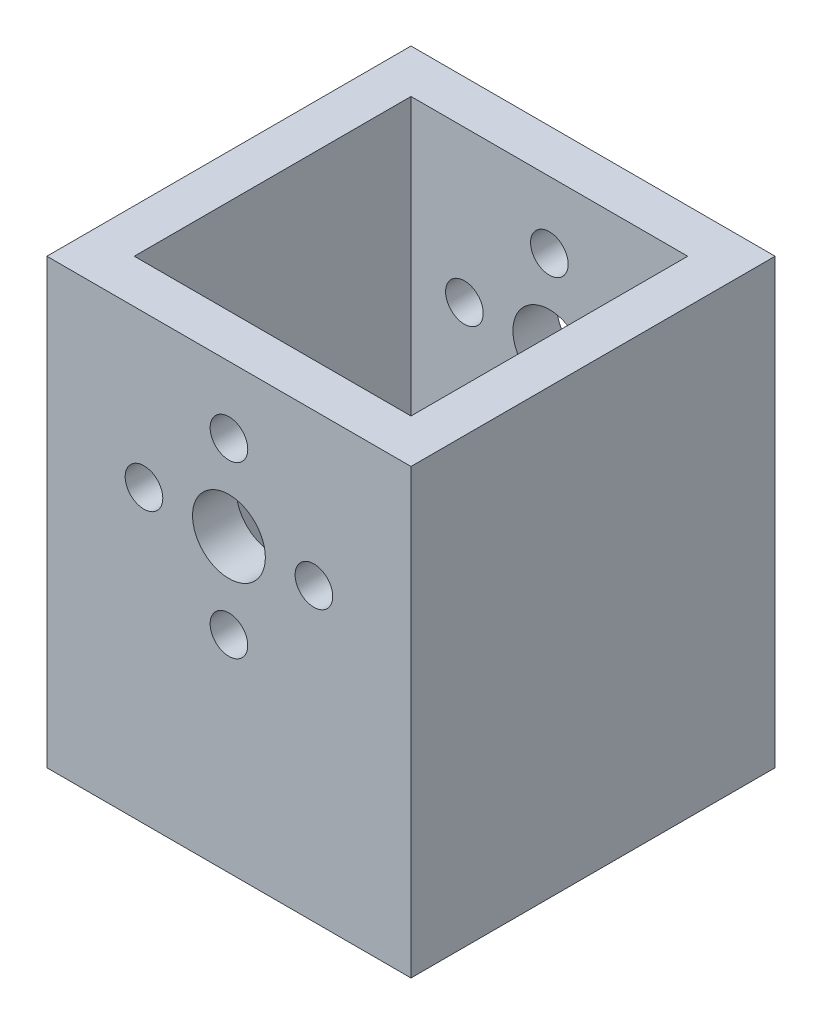
ISO-10303-21;
HEADER;
FILE_DESCRIPTION(('STEP AP214'),'2;1');
FILE_NAME('part.step','',(''),(''),'','','');
FILE_SCHEMA(('AUTOMOTIVE_DESIGN { 1 0 10303 214 1 1 1 1 }'));
ENDSEC;
DATA;
#1=APPLICATION_CONTEXT('core data for automotive mechanical design processes');
#2=APPLICATION_PROTOCOL_DEFINITION('international standard','automotive_design',2000,#1);
#3=PRODUCT_CONTEXT('',#1,'mechanical');
#4=PRODUCT('Part','Part','',(#3));
#5=PRODUCT_RELATED_PRODUCT_CATEGORY('part','',(#4));
#6=PRODUCT_DEFINITION_FORMATION('','',#4);
#7=PRODUCT_DEFINITION_CONTEXT('part definition',#1,'design');
#8=PRODUCT_DEFINITION('design','',#6,#7);
#9=PRODUCT_DEFINITION_SHAPE('','',#8);
#10=(LENGTH_UNIT() NAMED_UNIT(*) SI_UNIT(.MILLI.,.METRE.));
#11=(NAMED_UNIT(*) PLANE_ANGLE_UNIT() SI_UNIT($,.RADIAN.));
#12=(NAMED_UNIT(*) SI_UNIT($,.STERADIAN.) SOLID_ANGLE_UNIT());
#13=UNCERTAINTY_MEASURE_WITH_UNIT(LENGTH_MEASURE(1.E-05),#10,'distance_accuracy_value','');
#14=(GEOMETRIC_REPRESENTATION_CONTEXT(3) GLOBAL_UNCERTAINTY_ASSIGNED_CONTEXT((#13)) GLOBAL_UNIT_ASSIGNED_CONTEXT((#10,
#11,#12)) REPRESENTATION_CONTEXT('',''));
#15=CARTESIAN_POINT('',(0.,0.,0.));
#16=DIRECTION('',(0.,0.,1.));
#17=DIRECTION('',(1.,0.,0.));
#18=AXIS2_PLACEMENT_3D('',#15,#16,#17);
#19=CARTESIAN_POINT('',(0.,0.,30.));
#20=DIRECTION('',(0.,0.,-1.));
#21=DIRECTION('',(-1.,0.,0.));
#22=AXIS2_PLACEMENT_3D('',#19,#20,#21);
#23=CYLINDRICAL_SURFACE('',#22,3.);
#24=CARTESIAN_POINT('',(0.,0.,3.6));
#25=DIRECTION('',(0.,0.,-1.));
#26=DIRECTION('',(-1.,0.,0.));
#27=AXIS2_PLACEMENT_3D('',#24,#25,#26);
#28=CIRCLE('',#27,3.);
#29=CARTESIAN_POINT('',(-3.,0.,3.6));
#30=VERTEX_POINT('',#29);
#31=EDGE_CURVE('E168',#30,#30,#28,.T.);
#32=ORIENTED_EDGE('',*,*,#31,.F.);
#33=EDGE_LOOP('',(#32));
#34=FACE_BOUND('',#33,.T.);
#35=CARTESIAN_POINT('',(0.,0.,0.));
#36=DIRECTION('',(0.,0.,1.));
#37=DIRECTION('',(1.,0.,0.));
#38=AXIS2_PLACEMENT_3D('',#35,#36,#37);
#39=CIRCLE('',#38,3.);
#40=CARTESIAN_POINT('',(3.,0.,0.));
#41=VERTEX_POINT('',#40);
#42=EDGE_CURVE('E208',#41,#41,#39,.T.);
#43=ORIENTED_EDGE('',*,*,#42,.F.);
#44=EDGE_LOOP('',(#43));
#45=FACE_BOUND('',#44,.T.);
#46=ADVANCED_FACE('F37',(#34,#45),#23,.F.);
#47=CARTESIAN_POINT('',(0.,-7.,30.));
#48=DIRECTION('',(0.,0.,-1.));
#49=DIRECTION('',(-1.,0.,0.));
#50=AXIS2_PLACEMENT_3D('',#47,#48,#49);
#51=CYLINDRICAL_SURFACE('',#50,1.55);
#52=CARTESIAN_POINT('',(0.,-7.,3.6));
#53=DIRECTION('',(0.,0.,-1.));
#54=DIRECTION('',(-1.,0.,0.));
#55=AXIS2_PLACEMENT_3D('',#52,#53,#54);
#56=CIRCLE('',#55,1.55);
#57=CARTESIAN_POINT('',(-1.55,-7.,3.6));
#58=VERTEX_POINT('',#57);
#59=EDGE_CURVE('E165',#58,#58,#56,.T.);
#60=ORIENTED_EDGE('',*,*,#59,.F.);
#61=EDGE_LOOP('',(#60));
#62=FACE_BOUND('',#61,.T.);
#63=CARTESIAN_POINT('',(0.,-7.,0.));
#64=DIRECTION('',(0.,0.,1.));
#65=DIRECTION('',(1.,0.,0.));
#66=AXIS2_PLACEMENT_3D('',#63,#64,#65);
#67=CIRCLE('',#66,1.55);
#68=CARTESIAN_POINT('',(1.55,-7.,0.));
#69=VERTEX_POINT('',#68);
#70=EDGE_CURVE('E205',#69,#69,#67,.T.);
#71=ORIENTED_EDGE('',*,*,#70,.F.);
#72=EDGE_LOOP('',(#71));
#73=FACE_BOUND('',#72,.T.);
#74=ADVANCED_FACE('F268',(#62,#73),#51,.F.);
#75=CARTESIAN_POINT('',(7.,0.,30.));
#76=DIRECTION('',(0.,0.,-1.));
#77=DIRECTION('',(-1.,0.,0.));
#78=AXIS2_PLACEMENT_3D('',#75,#76,#77);
#79=CYLINDRICAL_SURFACE('',#78,1.55);
#80=CARTESIAN_POINT('',(7.,0.,3.6));
#81=DIRECTION('',(0.,0.,-1.));
#82=DIRECTION('',(-1.,0.,0.));
#83=AXIS2_PLACEMENT_3D('',#80,#81,#82);
#84=CIRCLE('',#83,1.55);
#85=CARTESIAN_POINT('',(5.45,0.,3.6));
#86=VERTEX_POINT('',#85);
#87=EDGE_CURVE('E162',#86,#86,#84,.T.);
#88=ORIENTED_EDGE('',*,*,#87,.F.);
#89=EDGE_LOOP('',(#88));
#90=FACE_BOUND('',#89,.T.);
#91=CARTESIAN_POINT('',(7.,0.,0.));
#92=DIRECTION('',(0.,0.,1.));
#93=DIRECTION('',(1.,0.,0.));
#94=AXIS2_PLACEMENT_3D('',#91,#92,#93);
#95=CIRCLE('',#94,1.55);
#96=CARTESIAN_POINT('',(8.55,0.,0.));
#97=VERTEX_POINT('',#96);
#98=EDGE_CURVE('E202',#97,#97,#95,.T.);
#99=ORIENTED_EDGE('',*,*,#98,.F.);
#100=EDGE_LOOP('',(#99));
#101=FACE_BOUND('',#100,.T.);
#102=ADVANCED_FACE('F274',(#90,#101),#79,.F.);
#103=CARTESIAN_POINT('',(0.,7.,30.));
#104=DIRECTION('',(0.,0.,-1.));
#105=DIRECTION('',(-1.,0.,0.));
#106=AXIS2_PLACEMENT_3D('',#103,#104,#105);
#107=CYLINDRICAL_SURFACE('',#106,1.55);
#108=CARTESIAN_POINT('',(0.,7.,3.6));
#109=DIRECTION('',(0.,0.,-1.));
#110=DIRECTION('',(-1.,0.,0.));
#111=AXIS2_PLACEMENT_3D('',#108,#109,#110);
#112=CIRCLE('',#111,1.55);
#113=CARTESIAN_POINT('',(-1.55,7.,3.6));
#114=VERTEX_POINT('',#113);
#115=EDGE_CURVE('E159',#114,#114,#112,.T.);
#116=ORIENTED_EDGE('',*,*,#115,.F.);
#117=EDGE_LOOP('',(#116));
#118=FACE_BOUND('',#117,.T.);
#119=CARTESIAN_POINT('',(0.,7.,0.));
#120=DIRECTION('',(0.,0.,1.));
#121=DIRECTION('',(1.,0.,0.));
#122=AXIS2_PLACEMENT_3D('',#119,#120,#121);
#123=CIRCLE('',#122,1.55);
#124=CARTESIAN_POINT('',(1.55,7.,0.));
#125=VERTEX_POINT('',#124);
#126=EDGE_CURVE('E199',#125,#125,#123,.T.);
#127=ORIENTED_EDGE('',*,*,#126,.F.);
#128=EDGE_LOOP('',(#127));
#129=FACE_BOUND('',#128,.T.);
#130=ADVANCED_FACE('F264',(#118,#129),#107,.F.);
#131=CARTESIAN_POINT('',(-7.,0.,30.));
#132=DIRECTION('',(0.,0.,-1.));
#133=DIRECTION('',(-1.,0.,0.));
#134=AXIS2_PLACEMENT_3D('',#131,#132,#133);
#135=CYLINDRICAL_SURFACE('',#134,1.55);
#136=CARTESIAN_POINT('',(-7.,0.,3.6));
#137=DIRECTION('',(0.,0.,-1.));
#138=DIRECTION('',(-1.,0.,0.));
#139=AXIS2_PLACEMENT_3D('',#136,#137,#138);
#140=CIRCLE('',#139,1.55);
#141=CARTESIAN_POINT('',(-8.55,0.,3.6));
#142=VERTEX_POINT('',#141);
#143=EDGE_CURVE('E41',#142,#142,#140,.T.);
#144=ORIENTED_EDGE('',*,*,#143,.F.);
#145=EDGE_LOOP('',(#144));
#146=FACE_BOUND('',#145,.T.);
#147=CARTESIAN_POINT('',(-7.,0.,0.));
#148=DIRECTION('',(0.,0.,1.));
#149=DIRECTION('',(1.,0.,0.));
#150=AXIS2_PLACEMENT_3D('',#147,#148,#149);
#151=CIRCLE('',#150,1.55);
#152=CARTESIAN_POINT('',(-5.45,0.,0.));
#153=VERTEX_POINT('',#152);
#154=EDGE_CURVE('E171',#153,#153,#151,.T.);
#155=ORIENTED_EDGE('',*,*,#154,.F.);
#156=EDGE_LOOP('',(#155));
#157=FACE_BOUND('',#156,.T.);
#158=ADVANCED_FACE('F232',(#146,#157),#135,.F.);
#159=CARTESIAN_POINT('',(0.,12.5,30.));
#160=DIRECTION('',(0.,1.,0.));
#161=DIRECTION('',(0.,0.,1.));
#162=AXIS2_PLACEMENT_3D('',#159,#160,#161);
#163=PLANE('',#162);
#164=DIRECTION('',(0.,0.,1.));
#165=VECTOR('',#164,1.);
#166=CARTESIAN_POINT('',(-11.4,12.5,15.));
#167=LINE('',#166,#165);
#168=CARTESIAN_POINT('',(-11.4,12.5,3.6));
#169=VERTEX_POINT('',#168);
#170=CARTESIAN_POINT('',(-11.4,12.5,26.4));
#171=VERTEX_POINT('',#170);
#172=EDGE_CURVE('E113',#169,#171,#167,.T.);
#173=ORIENTED_EDGE('',*,*,#172,.F.);
#174=DIRECTION('',(-1.,0.,0.));
#175=VECTOR('',#174,1.);
#176=CARTESIAN_POINT('',(0.,12.5,3.6));
#177=LINE('',#176,#175);
#178=CARTESIAN_POINT('',(11.4,12.5,3.6));
#179=VERTEX_POINT('',#178);
#180=EDGE_CURVE('E129',#179,#169,#177,.T.);
#181=ORIENTED_EDGE('',*,*,#180,.F.);
#182=DIRECTION('',(0.,0.,-1.));
#183=VECTOR('',#182,1.);
#184=CARTESIAN_POINT('',(11.4,12.5,3.6));
#185=LINE('',#184,#183);
#186=CARTESIAN_POINT('',(11.4,12.5,26.4));
#187=VERTEX_POINT('',#186);
#188=EDGE_CURVE('E136',#187,#179,#185,.T.);
#189=ORIENTED_EDGE('',*,*,#188,.F.);
#190=DIRECTION('',(1.,0.,0.));
#191=VECTOR('',#190,1.);
#192=CARTESIAN_POINT('',(11.4,12.5,26.4));
#193=LINE('',#192,#191);
#194=EDGE_CURVE('E134',#171,#187,#193,.T.);
#195=ORIENTED_EDGE('',*,*,#194,.F.);
#196=EDGE_LOOP('',(#173,#181,#189,#195));
#197=FACE_BOUND('',#196,.T.);
#198=DIRECTION('',(1.,0.,0.));
#199=VECTOR('',#198,1.);
#200=CARTESIAN_POINT('',(0.,12.5,0.));
#201=LINE('',#200,#199);
#202=CARTESIAN_POINT('',(-15.,12.5,0.));
#203=VERTEX_POINT('',#202);
#204=CARTESIAN_POINT('',(15.,12.5,0.));
#205=VERTEX_POINT('',#204);
#206=EDGE_CURVE('E211',#203,#205,#201,.T.);
#207=ORIENTED_EDGE('',*,*,#206,.F.);
#208=DIRECTION('',(0.,0.,-1.));
#209=VECTOR('',#208,1.);
#210=CARTESIAN_POINT('',(-15.,12.5,30.));
#211=LINE('',#210,#209);
#212=CARTESIAN_POINT('',(-15.,12.5,30.));
#213=VERTEX_POINT('',#212);
#214=EDGE_CURVE('E11',#213,#203,#211,.T.);
#215=ORIENTED_EDGE('',*,*,#214,.F.);
#216=DIRECTION('',(1.,0.,0.));
#217=VECTOR('',#216,1.);
#218=CARTESIAN_POINT('',(0.,12.5,30.));
#219=LINE('',#218,#217);
#220=CARTESIAN_POINT('',(15.,12.5,30.));
#221=VERTEX_POINT('',#220);
#222=EDGE_CURVE('E188',#213,#221,#219,.T.);
#223=ORIENTED_EDGE('',*,*,#222,.T.);
#224=DIRECTION('',(0.,0.,-1.));
#225=VECTOR('',#224,1.);
#226=CARTESIAN_POINT('',(15.,12.5,30.));
#227=LINE('',#226,#225);
#228=EDGE_CURVE('E63',#221,#205,#227,.T.);
#229=ORIENTED_EDGE('',*,*,#228,.T.);
#230=EDGE_LOOP('',(#207,#215,#223,#229));
#231=FACE_BOUND('',#230,.T.);
#232=ADVANCED_FACE('F252',(#197,#231),#163,.T.);
#233=CARTESIAN_POINT('',(-15.,0.,30.));
#234=DIRECTION('',(1.,0.,0.));
#235=DIRECTION('',(0.,1.,0.));
#236=AXIS2_PLACEMENT_3D('',#233,#234,#235);
#237=PLANE('',#236);
#238=DIRECTION('',(0.,-1.,0.));
#239=VECTOR('',#238,1.);
#240=CARTESIAN_POINT('',(-15.,0.,0.));
#241=LINE('',#240,#239);
#242=CARTESIAN_POINT('',(-15.,-24.,0.));
#243=VERTEX_POINT('',#242);
#244=EDGE_CURVE('E213',#203,#243,#241,.T.);
#245=ORIENTED_EDGE('',*,*,#244,.T.);
#246=DIRECTION('',(0.,0.,-1.));
#247=VECTOR('',#246,1.);
#248=CARTESIAN_POINT('',(-15.,-24.,30.));
#249=LINE('',#248,#247);
#250=CARTESIAN_POINT('',(-15.,-24.,30.));
#251=VERTEX_POINT('',#250);
#252=EDGE_CURVE('E46',#251,#243,#249,.T.);
#253=ORIENTED_EDGE('',*,*,#252,.F.);
#254=DIRECTION('',(0.,-1.,0.));
#255=VECTOR('',#254,1.);
#256=CARTESIAN_POINT('',(-15.,0.,30.));
#257=LINE('',#256,#255);
#258=EDGE_CURVE('E190',#213,#251,#257,.T.);
#259=ORIENTED_EDGE('',*,*,#258,.F.);
#260=ORIENTED_EDGE('',*,*,#214,.T.);
#261=EDGE_LOOP('',(#245,#253,#259,#260));
#262=FACE_BOUND('',#261,.T.);
#263=ADVANCED_FACE('F254',(#262),#237,.F.);
#264=CARTESIAN_POINT('',(0.,-24.,30.));
#265=DIRECTION('',(0.,-1.,0.));
#266=DIRECTION('',(1.,0.,0.));
#267=AXIS2_PLACEMENT_3D('',#264,#265,#266);
#268=PLANE('',#267);
#269=DIRECTION('',(-1.,0.,0.));
#270=VECTOR('',#269,1.);
#271=CARTESIAN_POINT('',(0.,-24.,0.));
#272=LINE('',#271,#270);
#273=CARTESIAN_POINT('',(15.,-24.,0.));
#274=VERTEX_POINT('',#273);
#275=EDGE_CURVE('E216',#274,#243,#272,.T.);
#276=ORIENTED_EDGE('',*,*,#275,.F.);
#277=DIRECTION('',(0.,0.,-1.));
#278=VECTOR('',#277,1.);
#279=CARTESIAN_POINT('',(15.,-24.,30.));
#280=LINE('',#279,#278);
#281=CARTESIAN_POINT('',(15.,-24.,30.));
#282=VERTEX_POINT('',#281);
#283=EDGE_CURVE('E222',#282,#274,#280,.T.);
#284=ORIENTED_EDGE('',*,*,#283,.F.);
#285=DIRECTION('',(-1.,0.,0.));
#286=VECTOR('',#285,1.);
#287=CARTESIAN_POINT('',(0.,-24.,30.));
#288=LINE('',#287,#286);
#289=EDGE_CURVE('E192',#282,#251,#288,.T.);
#290=ORIENTED_EDGE('',*,*,#289,.T.);
#291=ORIENTED_EDGE('',*,*,#252,.T.);
#292=EDGE_LOOP('',(#276,#284,#290,#291));
#293=FACE_BOUND('',#292,.T.);
#294=ADVANCED_FACE('F261',(#293),#268,.T.);
#295=CARTESIAN_POINT('',(0.,0.,26.4));
#296=DIRECTION('',(0.,0.,1.));
#297=DIRECTION('',(1.,0.,0.));
#298=AXIS2_PLACEMENT_3D('',#295,#296,#297);
#299=CIRCLE('',#298,3.);
#300=CARTESIAN_POINT('',(3.,0.,26.4));
#301=VERTEX_POINT('',#300);
#302=EDGE_CURVE('E156',#301,#301,#299,.T.);
#303=ORIENTED_EDGE('',*,*,#302,.F.);
#304=EDGE_LOOP('',(#303));
#305=FACE_BOUND('',#304,.T.);
#306=CARTESIAN_POINT('',(0.,0.,30.));
#307=DIRECTION('',(0.,0.,1.));
#308=DIRECTION('',(1.,0.,0.));
#309=AXIS2_PLACEMENT_3D('',#306,#307,#308);
#310=CIRCLE('',#309,3.);
#311=CARTESIAN_POINT('',(3.,0.,30.));
#312=VERTEX_POINT('',#311);
#313=EDGE_CURVE('E185',#312,#312,#310,.T.);
#314=ORIENTED_EDGE('',*,*,#313,.T.);
#315=EDGE_LOOP('',(#314));
#316=FACE_BOUND('',#315,.T.);
#317=ADVANCED_FACE('F270',(#305,#316),#23,.F.);
#318=CARTESIAN_POINT('',(0.,-7.,26.4));
#319=DIRECTION('',(0.,0.,1.));
#320=DIRECTION('',(1.,0.,0.));
#321=AXIS2_PLACEMENT_3D('',#318,#319,#320);
#322=CIRCLE('',#321,1.55);
#323=CARTESIAN_POINT('',(1.55,-7.,26.4));
#324=VERTEX_POINT('',#323);
#325=EDGE_CURVE('E153',#324,#324,#322,.T.);
#326=ORIENTED_EDGE('',*,*,#325,.F.);
#327=EDGE_LOOP('',(#326));
#328=FACE_BOUND('',#327,.T.);
#329=CARTESIAN_POINT('',(0.,-7.,30.));
#330=DIRECTION('',(0.,0.,1.));
#331=DIRECTION('',(1.,0.,0.));
#332=AXIS2_PLACEMENT_3D('',#329,#330,#331);
#333=CIRCLE('',#332,1.55);
#334=CARTESIAN_POINT('',(1.55,-7.,30.));
#335=VERTEX_POINT('',#334);
#336=EDGE_CURVE('E182',#335,#335,#333,.T.);
#337=ORIENTED_EDGE('',*,*,#336,.T.);
#338=EDGE_LOOP('',(#337));
#339=FACE_BOUND('',#338,.T.);
#340=ADVANCED_FACE('F277',(#328,#339),#51,.F.);
#341=CARTESIAN_POINT('',(7.,0.,26.4));
#342=DIRECTION('',(0.,0.,1.));
#343=DIRECTION('',(1.,0.,0.));
#344=AXIS2_PLACEMENT_3D('',#341,#342,#343);
#345=CIRCLE('',#344,1.55);
#346=CARTESIAN_POINT('',(8.55,0.,26.4));
#347=VERTEX_POINT('',#346);
#348=EDGE_CURVE('E150',#347,#347,#345,.T.);
#349=ORIENTED_EDGE('',*,*,#348,.F.);
#350=EDGE_LOOP('',(#349));
#351=FACE_BOUND('',#350,.T.);
#352=CARTESIAN_POINT('',(7.,0.,30.));
#353=DIRECTION('',(0.,0.,1.));
#354=DIRECTION('',(1.,0.,0.));
#355=AXIS2_PLACEMENT_3D('',#352,#353,#354);
#356=CIRCLE('',#355,1.55);
#357=CARTESIAN_POINT('',(8.55,0.,30.));
#358=VERTEX_POINT('',#357);
#359=EDGE_CURVE('E179',#358,#358,#356,.T.);
#360=ORIENTED_EDGE('',*,*,#359,.T.);
#361=EDGE_LOOP('',(#360));
#362=FACE_BOUND('',#361,.T.);
#363=ADVANCED_FACE('F286',(#351,#362),#79,.F.);
#364=CARTESIAN_POINT('',(0.,7.,26.4));
#365=DIRECTION('',(0.,0.,1.));
#366=DIRECTION('',(1.,0.,0.));
#367=AXIS2_PLACEMENT_3D('',#364,#365,#366);
#368=CIRCLE('',#367,1.55);
#369=CARTESIAN_POINT('',(1.55,7.,26.4));
#370=VERTEX_POINT('',#369);
#371=EDGE_CURVE('E147',#370,#370,#368,.T.);
#372=ORIENTED_EDGE('',*,*,#371,.F.);
#373=EDGE_LOOP('',(#372));
#374=FACE_BOUND('',#373,.T.);
#375=CARTESIAN_POINT('',(0.,7.,30.));
#376=DIRECTION('',(0.,0.,1.));
#377=DIRECTION('',(1.,0.,0.));
#378=AXIS2_PLACEMENT_3D('',#375,#376,#377);
#379=CIRCLE('',#378,1.55);
#380=CARTESIAN_POINT('',(1.55,7.,30.));
#381=VERTEX_POINT('',#380);
#382=EDGE_CURVE('E175',#381,#381,#379,.T.);
#383=ORIENTED_EDGE('',*,*,#382,.T.);
#384=EDGE_LOOP('',(#383));
#385=FACE_BOUND('',#384,.T.);
#386=ADVANCED_FACE('F231',(#374,#385),#107,.F.);
#387=CARTESIAN_POINT('',(-7.,0.,26.4));
#388=DIRECTION('',(0.,0.,1.));
#389=DIRECTION('',(1.,0.,0.));
#390=AXIS2_PLACEMENT_3D('',#387,#388,#389);
#391=CIRCLE('',#390,1.55);
#392=CARTESIAN_POINT('',(-5.45,0.,26.4));
#393=VERTEX_POINT('',#392);
#394=EDGE_CURVE('E143',#393,#393,#391,.T.);
#395=ORIENTED_EDGE('',*,*,#394,.F.);
#396=EDGE_LOOP('',(#395));
#397=FACE_BOUND('',#396,.T.);
#398=CARTESIAN_POINT('',(-7.,0.,30.));
#399=DIRECTION('',(0.,0.,1.));
#400=DIRECTION('',(1.,0.,0.));
#401=AXIS2_PLACEMENT_3D('',#398,#399,#400);
#402=CIRCLE('',#401,1.55);
#403=CARTESIAN_POINT('',(-5.45,0.,30.));
#404=VERTEX_POINT('',#403);
#405=EDGE_CURVE('E172',#404,#404,#402,.T.);
#406=ORIENTED_EDGE('',*,*,#405,.T.);
#407=EDGE_LOOP('',(#406));
#408=FACE_BOUND('',#407,.T.);
#409=ADVANCED_FACE('F39',(#397,#408),#135,.F.);
#410=CARTESIAN_POINT('',(15.,0.,30.));
#411=DIRECTION('',(1.,0.,0.));
#412=DIRECTION('',(0.,1.,0.));
#413=AXIS2_PLACEMENT_3D('',#410,#411,#412);
#414=PLANE('',#413);
#415=DIRECTION('',(0.,-1.,0.));
#416=VECTOR('',#415,1.);
#417=CARTESIAN_POINT('',(15.,0.,0.));
#418=LINE('',#417,#416);
#419=EDGE_CURVE('E176',#205,#274,#418,.T.);
#420=ORIENTED_EDGE('',*,*,#419,.F.);
#421=ORIENTED_EDGE('',*,*,#228,.F.);
#422=DIRECTION('',(0.,-1.,0.));
#423=VECTOR('',#422,1.);
#424=CARTESIAN_POINT('',(15.,0.,30.));
#425=LINE('',#424,#423);
#426=EDGE_CURVE('E195',#221,#282,#425,.T.);
#427=ORIENTED_EDGE('',*,*,#426,.T.);
#428=ORIENTED_EDGE('',*,*,#283,.T.);
#429=EDGE_LOOP('',(#420,#421,#427,#428));
#430=FACE_BOUND('',#429,.T.);
#431=ADVANCED_FACE('F230',(#430),#414,.T.);
#432=CARTESIAN_POINT('',(0.,0.,30.));
#433=DIRECTION('',(0.,0.,1.));
#434=DIRECTION('',(1.,0.,0.));
#435=AXIS2_PLACEMENT_3D('',#432,#433,#434);
#436=PLANE('',#435);
#437=ORIENTED_EDGE('',*,*,#405,.F.);
#438=EDGE_LOOP('',(#437));
#439=FACE_BOUND('',#438,.T.);
#440=ORIENTED_EDGE('',*,*,#382,.F.);
#441=EDGE_LOOP('',(#440));
#442=FACE_BOUND('',#441,.T.);
#443=ORIENTED_EDGE('',*,*,#359,.F.);
#444=EDGE_LOOP('',(#443));
#445=FACE_BOUND('',#444,.T.);
#446=ORIENTED_EDGE('',*,*,#336,.F.);
#447=EDGE_LOOP('',(#446));
#448=FACE_BOUND('',#447,.T.);
#449=ORIENTED_EDGE('',*,*,#313,.F.);
#450=EDGE_LOOP('',(#449));
#451=FACE_BOUND('',#450,.T.);
#452=ORIENTED_EDGE('',*,*,#222,.F.);
#453=ORIENTED_EDGE('',*,*,#258,.T.);
#454=ORIENTED_EDGE('',*,*,#289,.F.);
#455=ORIENTED_EDGE('',*,*,#426,.F.);
#456=EDGE_LOOP('',(#452,#453,#454,#455));
#457=FACE_BOUND('',#456,.T.);
#458=ADVANCED_FACE('F235',(#439,#442,#445,#448,#451,#457),#436,.T.);
#459=CARTESIAN_POINT('',(0.,0.,0.));
#460=DIRECTION('',(0.,0.,1.));
#461=DIRECTION('',(1.,0.,0.));
#462=AXIS2_PLACEMENT_3D('',#459,#460,#461);
#463=PLANE('',#462);
#464=ORIENTED_EDGE('',*,*,#154,.T.);
#465=EDGE_LOOP('',(#464));
#466=FACE_BOUND('',#465,.T.);
#467=ORIENTED_EDGE('',*,*,#126,.T.);
#468=EDGE_LOOP('',(#467));
#469=FACE_BOUND('',#468,.T.);
#470=ORIENTED_EDGE('',*,*,#98,.T.);
#471=EDGE_LOOP('',(#470));
#472=FACE_BOUND('',#471,.T.);
#473=ORIENTED_EDGE('',*,*,#70,.T.);
#474=EDGE_LOOP('',(#473));
#475=FACE_BOUND('',#474,.T.);
#476=ORIENTED_EDGE('',*,*,#42,.T.);
#477=EDGE_LOOP('',(#476));
#478=FACE_BOUND('',#477,.T.);
#479=ORIENTED_EDGE('',*,*,#206,.T.);
#480=ORIENTED_EDGE('',*,*,#419,.T.);
#481=ORIENTED_EDGE('',*,*,#275,.T.);
#482=ORIENTED_EDGE('',*,*,#244,.F.);
#483=EDGE_LOOP('',(#479,#480,#481,#482));
#484=FACE_BOUND('',#483,.T.);
#485=ADVANCED_FACE('F238',(#466,#469,#472,#475,#478,#484),#463,.F.);
#486=CARTESIAN_POINT('',(-11.4,-21.,15.));
#487=DIRECTION('',(-1.,0.,0.));
#488=DIRECTION('',(0.,0.,1.));
#489=AXIS2_PLACEMENT_3D('',#486,#487,#488);
#490=PLANE('',#489);
#491=ORIENTED_EDGE('',*,*,#172,.T.);
#492=DIRECTION('',(0.,1.,0.));
#493=VECTOR('',#492,1.);
#494=CARTESIAN_POINT('',(-11.4,-21.,26.4));
#495=LINE('',#494,#493);
#496=CARTESIAN_POINT('',(-11.4,-21.,26.4));
#497=VERTEX_POINT('',#496);
#498=EDGE_CURVE('E54',#497,#171,#495,.T.);
#499=ORIENTED_EDGE('',*,*,#498,.F.);
#500=DIRECTION('',(0.,0.,1.));
#501=VECTOR('',#500,1.);
#502=CARTESIAN_POINT('',(-11.4,-21.,15.));
#503=LINE('',#502,#501);
#504=CARTESIAN_POINT('',(-11.4,-21.,3.6));
#505=VERTEX_POINT('',#504);
#506=EDGE_CURVE('E110',#505,#497,#503,.T.);
#507=ORIENTED_EDGE('',*,*,#506,.F.);
#508=DIRECTION('',(0.,1.,0.));
#509=VECTOR('',#508,1.);
#510=CARTESIAN_POINT('',(-11.4,-21.,3.6));
#511=LINE('',#510,#509);
#512=EDGE_CURVE('E141',#505,#169,#511,.T.);
#513=ORIENTED_EDGE('',*,*,#512,.T.);
#514=EDGE_LOOP('',(#491,#499,#507,#513));
#515=FACE_BOUND('',#514,.T.);
#516=ADVANCED_FACE('F108',(#515),#490,.F.);
#517=CARTESIAN_POINT('',(0.,-21.,3.6));
#518=DIRECTION('',(0.,0.,-1.));
#519=DIRECTION('',(-1.,0.,0.));
#520=AXIS2_PLACEMENT_3D('',#517,#518,#519);
#521=PLANE('',#520);
#522=ORIENTED_EDGE('',*,*,#31,.T.);
#523=EDGE_LOOP('',(#522));
#524=FACE_BOUND('',#523,.T.);
#525=ORIENTED_EDGE('',*,*,#59,.T.);
#526=EDGE_LOOP('',(#525));
#527=FACE_BOUND('',#526,.T.);
#528=ORIENTED_EDGE('',*,*,#87,.T.);
#529=EDGE_LOOP('',(#528));
#530=FACE_BOUND('',#529,.T.);
#531=ORIENTED_EDGE('',*,*,#115,.T.);
#532=EDGE_LOOP('',(#531));
#533=FACE_BOUND('',#532,.T.);
#534=ORIENTED_EDGE('',*,*,#143,.T.);
#535=EDGE_LOOP('',(#534));
#536=FACE_BOUND('',#535,.T.);
#537=ORIENTED_EDGE('',*,*,#180,.T.);
#538=ORIENTED_EDGE('',*,*,#512,.F.);
#539=DIRECTION('',(-1.,0.,0.));
#540=VECTOR('',#539,1.);
#541=CARTESIAN_POINT('',(0.,-21.,3.6));
#542=LINE('',#541,#540);
#543=CARTESIAN_POINT('',(11.4,-21.,3.6));
#544=VERTEX_POINT('',#543);
#545=EDGE_CURVE('E116',#544,#505,#542,.T.);
#546=ORIENTED_EDGE('',*,*,#545,.F.);
#547=DIRECTION('',(0.,1.,0.));
#548=VECTOR('',#547,1.);
#549=CARTESIAN_POINT('',(11.4,-21.,3.6));
#550=LINE('',#549,#548);
#551=EDGE_CURVE('E144',#544,#179,#550,.T.);
#552=ORIENTED_EDGE('',*,*,#551,.T.);
#553=EDGE_LOOP('',(#537,#538,#546,#552));
#554=FACE_BOUND('',#553,.T.);
#555=ADVANCED_FACE('F339',(#524,#527,#530,#533,#536,#554),#521,.F.);
#556=CARTESIAN_POINT('',(11.4,-21.,3.6));
#557=DIRECTION('',(1.,0.,0.));
#558=DIRECTION('',(0.,0.,-1.));
#559=AXIS2_PLACEMENT_3D('',#556,#557,#558);
#560=PLANE('',#559);
#561=ORIENTED_EDGE('',*,*,#188,.T.);
#562=ORIENTED_EDGE('',*,*,#551,.F.);
#563=DIRECTION('',(0.,0.,-1.));
#564=VECTOR('',#563,1.);
#565=CARTESIAN_POINT('',(11.4,-21.,3.6));
#566=LINE('',#565,#564);
#567=CARTESIAN_POINT('',(11.4,-21.,26.4));
#568=VERTEX_POINT('',#567);
#569=EDGE_CURVE('E124',#568,#544,#566,.T.);
#570=ORIENTED_EDGE('',*,*,#569,.F.);
#571=DIRECTION('',(0.,1.,0.));
#572=VECTOR('',#571,1.);
#573=CARTESIAN_POINT('',(11.4,-21.,26.4));
#574=LINE('',#573,#572);
#575=EDGE_CURVE('E115',#568,#187,#574,.T.);
#576=ORIENTED_EDGE('',*,*,#575,.T.);
#577=EDGE_LOOP('',(#561,#562,#570,#576));
#578=FACE_BOUND('',#577,.T.);
#579=ADVANCED_FACE('F295',(#578),#560,.F.);
#580=CARTESIAN_POINT('',(11.4,-21.,26.4));
#581=DIRECTION('',(0.,0.,1.));
#582=DIRECTION('',(1.,0.,0.));
#583=AXIS2_PLACEMENT_3D('',#580,#581,#582);
#584=PLANE('',#583);
#585=ORIENTED_EDGE('',*,*,#302,.T.);
#586=EDGE_LOOP('',(#585));
#587=FACE_BOUND('',#586,.T.);
#588=ORIENTED_EDGE('',*,*,#325,.T.);
#589=EDGE_LOOP('',(#588));
#590=FACE_BOUND('',#589,.T.);
#591=ORIENTED_EDGE('',*,*,#348,.T.);
#592=EDGE_LOOP('',(#591));
#593=FACE_BOUND('',#592,.T.);
#594=ORIENTED_EDGE('',*,*,#371,.T.);
#595=EDGE_LOOP('',(#594));
#596=FACE_BOUND('',#595,.T.);
#597=ORIENTED_EDGE('',*,*,#394,.T.);
#598=EDGE_LOOP('',(#597));
#599=FACE_BOUND('',#598,.T.);
#600=ORIENTED_EDGE('',*,*,#194,.T.);
#601=ORIENTED_EDGE('',*,*,#575,.F.);
#602=DIRECTION('',(1.,0.,0.));
#603=VECTOR('',#602,1.);
#604=CARTESIAN_POINT('',(0.,-21.,26.4));
#605=LINE('',#604,#603);
#606=EDGE_CURVE('E119',#497,#568,#605,.T.);
#607=ORIENTED_EDGE('',*,*,#606,.F.);
#608=ORIENTED_EDGE('',*,*,#498,.T.);
#609=EDGE_LOOP('',(#600,#601,#607,#608));
#610=FACE_BOUND('',#609,.T.);
#611=ADVANCED_FACE('F120',(#587,#590,#593,#596,#599,#610),#584,.F.);
#612=CARTESIAN_POINT('',(0.,-21.,0.));
#613=DIRECTION('',(0.,-1.,0.));
#614=DIRECTION('',(0.,0.,-1.));
#615=AXIS2_PLACEMENT_3D('',#612,#613,#614);
#616=PLANE('',#615);
#617=ORIENTED_EDGE('',*,*,#506,.T.);
#618=ORIENTED_EDGE('',*,*,#606,.T.);
#619=ORIENTED_EDGE('',*,*,#569,.T.);
#620=ORIENTED_EDGE('',*,*,#545,.T.);
#621=EDGE_LOOP('',(#617,#618,#619,#620));
#622=FACE_BOUND('',#621,.T.);
#623=ADVANCED_FACE('F126',(#622),#616,.F.);
#624=CLOSED_SHELL('',(#46,#74,#102,#130,#158,#232,#263,#294,#317,#340,#363,#386,#409,#431,#458,
#485,#516,#555,#579,#611,#623));
#625=MANIFOLD_SOLID_BREP('B2',#624);
#626=ADVANCED_BREP_SHAPE_REPRESENTATION('',(#18,#625),#14);
#627=SHAPE_DEFINITION_REPRESENTATION(#9,#626);
ENDSEC;
END-ISO-10303-21;
